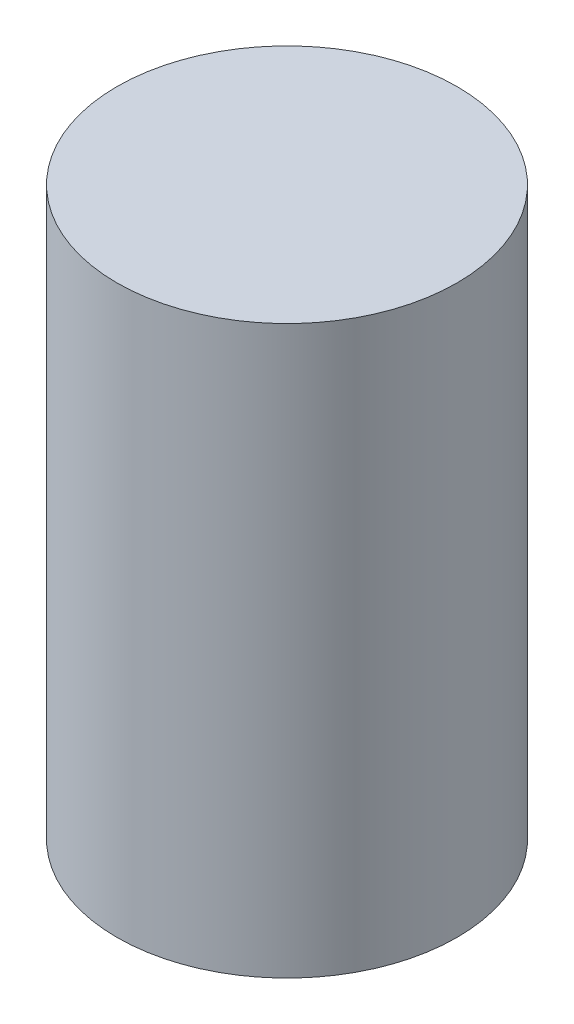
ISO-10303-21;
HEADER;
FILE_DESCRIPTION(('STEP AP214'),'2;1');
FILE_NAME('part.step','',(''),(''),'','','');
FILE_SCHEMA(('AUTOMOTIVE_DESIGN { 1 0 10303 214 1 1 1 1 }'));
ENDSEC;
DATA;
#1=APPLICATION_CONTEXT('core data for automotive mechanical design processes');
#2=APPLICATION_PROTOCOL_DEFINITION('international standard','automotive_design',2000,#1);
#3=PRODUCT_CONTEXT('',#1,'mechanical');
#4=PRODUCT('Part','Part','',(#3));
#5=PRODUCT_RELATED_PRODUCT_CATEGORY('part','',(#4));
#6=PRODUCT_DEFINITION_FORMATION('','',#4);
#7=PRODUCT_DEFINITION_CONTEXT('part definition',#1,'design');
#8=PRODUCT_DEFINITION('design','',#6,#7);
#9=PRODUCT_DEFINITION_SHAPE('','',#8);
#10=(LENGTH_UNIT() NAMED_UNIT(*) SI_UNIT(.MILLI.,.METRE.));
#11=(NAMED_UNIT(*) PLANE_ANGLE_UNIT() SI_UNIT($,.RADIAN.));
#12=(NAMED_UNIT(*) SI_UNIT($,.STERADIAN.) SOLID_ANGLE_UNIT());
#13=UNCERTAINTY_MEASURE_WITH_UNIT(LENGTH_MEASURE(1.E-05),#10,'distance_accuracy_value','');
#14=(GEOMETRIC_REPRESENTATION_CONTEXT(3) GLOBAL_UNCERTAINTY_ASSIGNED_CONTEXT((#13)) GLOBAL_UNIT_ASSIGNED_CONTEXT((#10,
#11,#12)) REPRESENTATION_CONTEXT('',''));
#15=CARTESIAN_POINT('',(0.,0.,0.));
#16=DIRECTION('',(0.,0.,1.));
#17=DIRECTION('',(1.,0.,0.));
#18=AXIS2_PLACEMENT_3D('',#15,#16,#17);
#19=CARTESIAN_POINT('',(0.,-50.,0.));
#20=DIRECTION('',(0.,1.,0.));
#21=DIRECTION('',(-1.,0.,0.));
#22=AXIS2_PLACEMENT_3D('',#19,#20,#21);
#23=PLANE('',#22);
#24=CARTESIAN_POINT('',(0.,-50.,0.));
#25=DIRECTION('',(0.,1.,0.));
#26=DIRECTION('',(-1.,0.,0.));
#27=AXIS2_PLACEMENT_3D('',#24,#25,#26);
#28=CIRCLE('',#27,30.);
#29=CARTESIAN_POINT('',(-30.,-50.,0.));
#30=VERTEX_POINT('',#29);
#31=EDGE_CURVE('E10',#30,#30,#28,.T.);
#32=ORIENTED_EDGE('',*,*,#31,.F.);
#33=EDGE_LOOP('',(#32));
#34=FACE_BOUND('',#33,.T.);
#35=ADVANCED_FACE('F33',(#34),#23,.F.);
#36=CARTESIAN_POINT('',(0.,50.,0.));
#37=DIRECTION('',(0.,1.,0.));
#38=DIRECTION('',(-1.,0.,0.));
#39=AXIS2_PLACEMENT_3D('',#36,#37,#38);
#40=CYLINDRICAL_SURFACE('',#39,30.);
#41=CARTESIAN_POINT('',(0.,50.,0.));
#42=DIRECTION('',(0.,1.,0.));
#43=DIRECTION('',(-1.,0.,0.));
#44=AXIS2_PLACEMENT_3D('',#41,#42,#43);
#45=CIRCLE('',#44,30.);
#46=CARTESIAN_POINT('',(-30.,50.,0.));
#47=VERTEX_POINT('',#46);
#48=EDGE_CURVE('E39',#47,#47,#45,.T.);
#49=ORIENTED_EDGE('',*,*,#48,.F.);
#50=EDGE_LOOP('',(#49));
#51=FACE_BOUND('',#50,.T.);
#52=ORIENTED_EDGE('',*,*,#31,.T.);
#53=EDGE_LOOP('',(#52));
#54=FACE_BOUND('',#53,.T.);
#55=ADVANCED_FACE('F47',(#51,#54),#40,.T.);
#56=CARTESIAN_POINT('',(0.,50.,0.));
#57=DIRECTION('',(0.,-1.,0.));
#58=DIRECTION('',(1.,0.,0.));
#59=AXIS2_PLACEMENT_3D('',#56,#57,#58);
#60=PLANE('',#59);
#61=ORIENTED_EDGE('',*,*,#48,.T.);
#62=EDGE_LOOP('',(#61));
#63=FACE_BOUND('',#62,.T.);
#64=ADVANCED_FACE('F45',(#63),#60,.F.);
#65=CLOSED_SHELL('',(#35,#55,#64));
#66=MANIFOLD_SOLID_BREP('B2',#65);
#67=ADVANCED_BREP_SHAPE_REPRESENTATION('',(#18,#66),#14);
#68=SHAPE_DEFINITION_REPRESENTATION(#9,#67);
ENDSEC;
END-ISO-10303-21;
